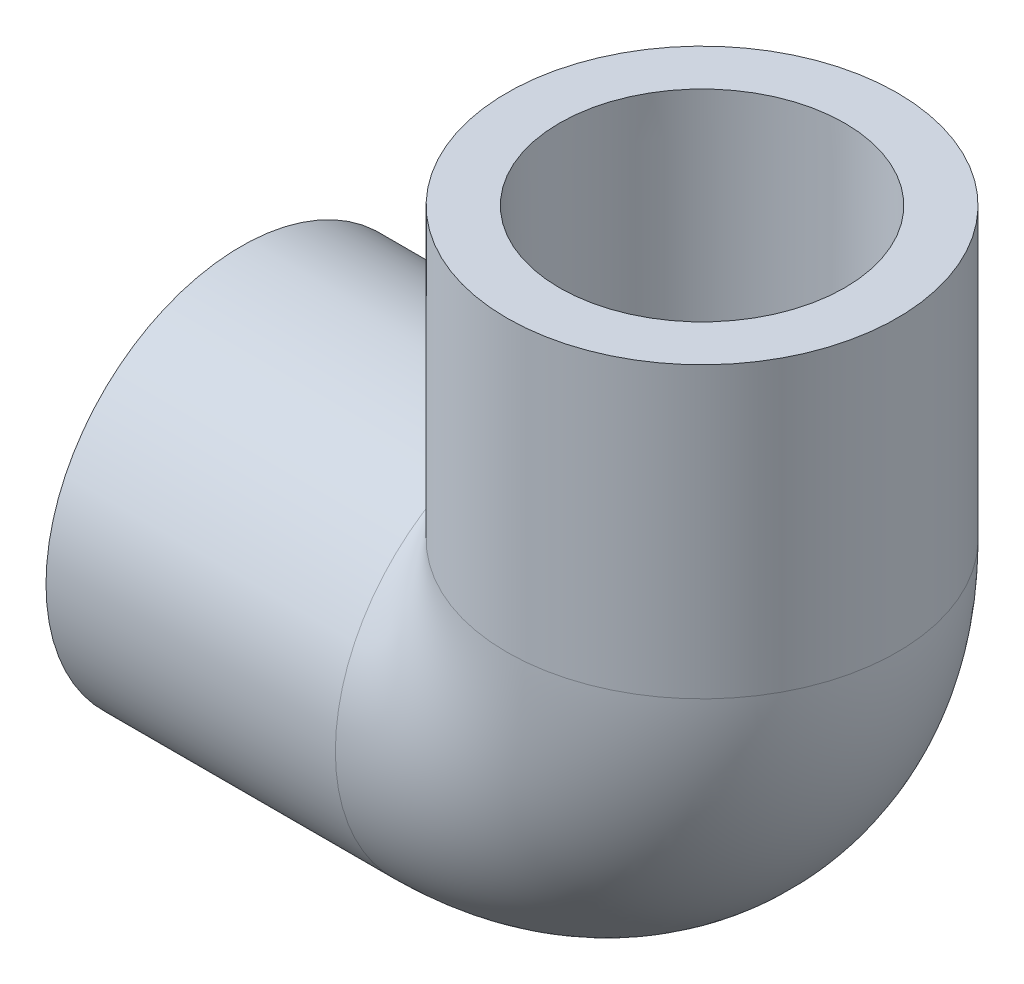
ISO-10303-21;
HEADER;
FILE_DESCRIPTION(('STEP AP214'),'2;1');
FILE_NAME('part.step','',(''),(''),'','','');
FILE_SCHEMA(('AUTOMOTIVE_DESIGN { 1 0 10303 214 1 1 1 1 }'));
ENDSEC;
DATA;
#1=APPLICATION_CONTEXT('core data for automotive mechanical design processes');
#2=APPLICATION_PROTOCOL_DEFINITION('international standard','automotive_design',2000,#1);
#3=PRODUCT_CONTEXT('',#1,'mechanical');
#4=PRODUCT('Part','Part','',(#3));
#5=PRODUCT_RELATED_PRODUCT_CATEGORY('part','',(#4));
#6=PRODUCT_DEFINITION_FORMATION('','',#4);
#7=PRODUCT_DEFINITION_CONTEXT('part definition',#1,'design');
#8=PRODUCT_DEFINITION('design','',#6,#7);
#9=PRODUCT_DEFINITION_SHAPE('','',#8);
#10=(LENGTH_UNIT() NAMED_UNIT(*) SI_UNIT(.MILLI.,.METRE.));
#11=(NAMED_UNIT(*) PLANE_ANGLE_UNIT() SI_UNIT($,.RADIAN.));
#12=(NAMED_UNIT(*) SI_UNIT($,.STERADIAN.) SOLID_ANGLE_UNIT());
#13=UNCERTAINTY_MEASURE_WITH_UNIT(LENGTH_MEASURE(1.E-05),#10,'distance_accuracy_value','');
#14=(GEOMETRIC_REPRESENTATION_CONTEXT(3) GLOBAL_UNCERTAINTY_ASSIGNED_CONTEXT((#13)) GLOBAL_UNIT_ASSIGNED_CONTEXT((#10,
#11,#12)) REPRESENTATION_CONTEXT('',''));
#15=CARTESIAN_POINT('',(0.,0.,0.));
#16=DIRECTION('',(0.,0.,1.));
#17=DIRECTION('',(1.,0.,0.));
#18=AXIS2_PLACEMENT_3D('',#15,#16,#17);
#19=CARTESIAN_POINT('',(-34.798,-14.732,0.));
#20=DIRECTION('',(-1.,0.,0.));
#21=DIRECTION('',(0.,0.,1.));
#22=AXIS2_PLACEMENT_3D('',#19,#20,#21);
#23=PLANE('',#22);
#24=CARTESIAN_POINT('',(-34.798,0.,0.));
#25=DIRECTION('',(-1.,0.,0.));
#26=DIRECTION('',(0.,0.,1.));
#27=AXIS2_PLACEMENT_3D('',#24,#25,#26);
#28=CIRCLE('',#27,14.732);
#29=CARTESIAN_POINT('',(-34.798,0.,14.732));
#30=VERTEX_POINT('',#29);
#31=EDGE_CURVE('E52',#30,#30,#28,.T.);
#32=ORIENTED_EDGE('',*,*,#31,.T.);
#33=EDGE_LOOP('',(#32));
#34=FACE_BOUND('',#33,.T.);
#35=CARTESIAN_POINT('',(-34.798,0.,0.));
#36=DIRECTION('',(-1.,0.,0.));
#37=DIRECTION('',(0.,0.,1.));
#38=AXIS2_PLACEMENT_3D('',#35,#36,#37);
#39=CIRCLE('',#38,10.7696);
#40=CARTESIAN_POINT('',(-34.798,0.,10.7696));
#41=VERTEX_POINT('',#40);
#42=EDGE_CURVE('E39',#41,#41,#39,.T.);
#43=ORIENTED_EDGE('',*,*,#42,.F.);
#44=EDGE_LOOP('',(#43));
#45=FACE_BOUND('',#44,.T.);
#46=ADVANCED_FACE('F32',(#34,#45),#23,.T.);
#47=CARTESIAN_POINT('',(-12.954,0.,0.));
#48=DIRECTION('',(-1.,0.,0.));
#49=DIRECTION('',(0.,0.,1.));
#50=AXIS2_PLACEMENT_3D('',#47,#48,#49);
#51=CONICAL_SURFACE('',#50,10.6172,0.0069766309917721);
#52=ORIENTED_EDGE('',*,*,#42,.T.);
#53=EDGE_LOOP('',(#52));
#54=FACE_BOUND('',#53,.T.);
#55=CARTESIAN_POINT('',(-12.954,0.,0.));
#56=DIRECTION('',(-1.,0.,0.));
#57=DIRECTION('',(0.,0.,1.));
#58=AXIS2_PLACEMENT_3D('',#55,#56,#57);
#59=CIRCLE('',#58,10.6172);
#60=CARTESIAN_POINT('',(-12.954,0.,10.6172));
#61=VERTEX_POINT('',#60);
#62=EDGE_CURVE('E63',#61,#61,#59,.T.);
#63=ORIENTED_EDGE('',*,*,#62,.F.);
#64=EDGE_LOOP('',(#63));
#65=FACE_BOUND('',#64,.T.);
#66=ADVANCED_FACE('F72',(#54,#65),#51,.F.);
#67=CARTESIAN_POINT('',(-34.798,0.,0.));
#68=DIRECTION('',(-1.,0.,0.));
#69=DIRECTION('',(0.,0.,1.));
#70=AXIS2_PLACEMENT_3D('',#67,#68,#69);
#71=CYLINDRICAL_SURFACE('',#70,14.732);
#72=CARTESIAN_POINT('',(0.,0.,0.));
#73=DIRECTION('',(-0.707106781186547,-0.707106781186547,0.));
#74=DIRECTION('',(-0.707106781186547,0.707106781186547,0.));
#75=AXIS2_PLACEMENT_3D('',#72,#73,#74);
#76=ELLIPSE('',#75,20.8341942008804,14.732);
#77=CARTESIAN_POINT('',(-12.954,12.954,-7.01610347700203));
#78=VERTEX_POINT('',#77);
#79=CARTESIAN_POINT('',(-12.954,12.954,7.01610347700202));
#80=VERTEX_POINT('',#79);
#81=EDGE_CURVE('E51',#78,#80,#76,.F.);
#82=ORIENTED_EDGE('',*,*,#81,.F.);
#83=CARTESIAN_POINT('',(-12.954,0.,0.));
#84=DIRECTION('',(-1.,0.,0.));
#85=DIRECTION('',(0.,0.,1.));
#86=AXIS2_PLACEMENT_3D('',#83,#84,#85);
#87=CIRCLE('',#86,14.732);
#88=EDGE_CURVE('E58',#78,#80,#87,.T.);
#89=ORIENTED_EDGE('',*,*,#88,.T.);
#90=EDGE_LOOP('',(#82,#89));
#91=FACE_BOUND('',#90,.T.);
#92=ORIENTED_EDGE('',*,*,#31,.F.);
#93=EDGE_LOOP('',(#92));
#94=FACE_BOUND('',#93,.T.);
#95=ADVANCED_FACE('F56',(#91,#94),#71,.T.);
#96=CARTESIAN_POINT('',(-12.954,12.954,0.));
#97=DIRECTION('',(0.,0.,-1.));
#98=DIRECTION('',(-1.,0.,0.));
#99=AXIS2_PLACEMENT_3D('',#96,#97,#98);
#100=TOROIDAL_SURFACE('',#99,12.954,6.9342);
#101=CARTESIAN_POINT('',(0.,12.954,0.));
#102=DIRECTION('',(0.,1.,0.));
#103=DIRECTION('',(0.,0.,-1.));
#104=AXIS2_PLACEMENT_3D('',#101,#102,#103);
#105=CIRCLE('',#104,6.9342);
#106=CARTESIAN_POINT('',(6.9342,12.954,0.));
#107=VERTEX_POINT('',#106);
#108=EDGE_CURVE('E53',#107,#107,#105,.T.);
#109=CARTESIAN_POINT('',(-12.954,0.,0.));
#110=DIRECTION('',(1.,0.,0.));
#111=DIRECTION('',(0.,0.,-1.));
#112=AXIS2_PLACEMENT_3D('',#109,#110,#111);
#113=CIRCLE('',#112,6.9342);
#114=CARTESIAN_POINT('',(-12.954,-6.9342,0.));
#115=VERTEX_POINT('',#114);
#116=EDGE_CURVE('E59',#115,#115,#113,.T.);
#117=CARTESIAN_POINT('',(-12.954,12.954,0.));
#118=DIRECTION('',(0.,0.,-1.));
#119=DIRECTION('',(-1.,0.,0.));
#120=AXIS2_PLACEMENT_3D('',#117,#118,#119);
#121=CIRCLE('',#120,19.8882);
#122=EDGE_CURVE('',#107,#115,#121,.T.);
#123=ORIENTED_EDGE('',*,*,#108,.T.);
#124=ORIENTED_EDGE('',*,*,#116,.F.);
#125=ORIENTED_EDGE('',*,*,#122,.T.);
#126=ORIENTED_EDGE('',*,*,#122,.F.);
#127=EDGE_LOOP('',(#123,#125,#124,#126));
#128=FACE_BOUND('',#127,.T.);
#129=ADVANCED_FACE('F82',(#128),#100,.F.);
#130=CARTESIAN_POINT('',(-25.908,12.954,0.));
#131=DIRECTION('',(0.,-1.,0.));
#132=DIRECTION('',(-1.,0.,0.));
#133=AXIS2_PLACEMENT_3D('',#130,#131,#132);
#134=CIRCLE('',#133,14.732);
#135=TRIMMED_CURVE('',#134,(PARAMETER_VALUE(-2.64520848846067)),
(PARAMETER_VALUE(2.64520848846067)),.T.,.PARAMETER.);
#136=CARTESIAN_POINT('',(-12.954,12.954,0.));
#137=DIRECTION('',(0.,0.,-1.));
#138=AXIS1_PLACEMENT('',#136,#137);
#139=SURFACE_OF_REVOLUTION('',#135,#138);
#140=CARTESIAN_POINT('',(0.,12.954,0.));
#141=DIRECTION('',(0.,1.,0.));
#142=DIRECTION('',(0.,0.,-1.));
#143=AXIS2_PLACEMENT_3D('',#140,#141,#142);
#144=CIRCLE('',#143,14.732);
#145=EDGE_CURVE('E45',#80,#78,#144,.T.);
#146=ORIENTED_EDGE('',*,*,#145,.F.);
#147=ORIENTED_EDGE('',*,*,#88,.F.);
#148=EDGE_LOOP('',(#146,#147));
#149=FACE_BOUND('',#148,.T.);
#150=ADVANCED_FACE('F62',(#149),#139,.T.);
#151=CARTESIAN_POINT('',(0.,12.954,0.));
#152=DIRECTION('',(0.,1.,0.));
#153=DIRECTION('',(0.,0.,-1.));
#154=AXIS2_PLACEMENT_3D('',#151,#152,#153);
#155=PLANE('',#154);
#156=CARTESIAN_POINT('',(0.,12.954,0.));
#157=DIRECTION('',(0.,1.,0.));
#158=DIRECTION('',(-1.,0.,0.));
#159=AXIS2_PLACEMENT_3D('',#156,#157,#158);
#160=CIRCLE('',#159,10.6172);
#161=CARTESIAN_POINT('',(-10.6172,12.954,0.));
#162=VERTEX_POINT('',#161);
#163=EDGE_CURVE('E11',#162,#162,#160,.F.);
#164=ORIENTED_EDGE('',*,*,#163,.F.);
#165=EDGE_LOOP('',(#164));
#166=FACE_BOUND('',#165,.T.);
#167=ORIENTED_EDGE('',*,*,#108,.F.);
#168=EDGE_LOOP('',(#167));
#169=FACE_BOUND('',#168,.T.);
#170=ADVANCED_FACE('F89',(#166,#169),#155,.T.);
#171=CARTESIAN_POINT('',(-12.954,0.,0.));
#172=DIRECTION('',(1.,0.,0.));
#173=DIRECTION('',(0.,0.,-1.));
#174=AXIS2_PLACEMENT_3D('',#171,#172,#173);
#175=PLANE('',#174);
#176=ORIENTED_EDGE('',*,*,#62,.T.);
#177=EDGE_LOOP('',(#176));
#178=FACE_BOUND('',#177,.T.);
#179=ORIENTED_EDGE('',*,*,#116,.T.);
#180=EDGE_LOOP('',(#179));
#181=FACE_BOUND('',#180,.T.);
#182=ADVANCED_FACE('F92',(#178,#181),#175,.F.);
#183=CARTESIAN_POINT('',(14.732,34.798,0.));
#184=DIRECTION('',(0.,1.,0.));
#185=DIRECTION('',(0.,0.,1.));
#186=AXIS2_PLACEMENT_3D('',#183,#184,#185);
#187=PLANE('',#186);
#188=CARTESIAN_POINT('',(0.,34.798,0.));
#189=DIRECTION('',(0.,-1.,0.));
#190=DIRECTION('',(0.,0.,-1.));
#191=AXIS2_PLACEMENT_3D('',#188,#189,#190);
#192=CIRCLE('',#191,10.7696);
#193=CARTESIAN_POINT('',(0.,34.798,-10.7696));
#194=VERTEX_POINT('',#193);
#195=EDGE_CURVE('E116',#194,#194,#192,.T.);
#196=ORIENTED_EDGE('',*,*,#195,.T.);
#197=EDGE_LOOP('',(#196));
#198=FACE_BOUND('',#197,.T.);
#199=CARTESIAN_POINT('',(0.,34.798,0.));
#200=DIRECTION('',(0.,-1.,0.));
#201=DIRECTION('',(0.,0.,-1.));
#202=AXIS2_PLACEMENT_3D('',#199,#200,#201);
#203=CIRCLE('',#202,14.732);
#204=CARTESIAN_POINT('',(0.,34.798,-14.732));
#205=VERTEX_POINT('',#204);
#206=EDGE_CURVE('E60',#205,#205,#203,.T.);
#207=ORIENTED_EDGE('',*,*,#206,.F.);
#208=EDGE_LOOP('',(#207));
#209=FACE_BOUND('',#208,.T.);
#210=ADVANCED_FACE('F99',(#198,#209),#187,.T.);
#211=CARTESIAN_POINT('',(0.,0.,0.));
#212=DIRECTION('',(0.,-1.,0.));
#213=DIRECTION('',(0.,0.,-1.));
#214=AXIS2_PLACEMENT_3D('',#211,#212,#213);
#215=CYLINDRICAL_SURFACE('',#214,14.732);
#216=ORIENTED_EDGE('',*,*,#206,.T.);
#217=EDGE_LOOP('',(#216));
#218=FACE_BOUND('',#217,.T.);
#219=ORIENTED_EDGE('',*,*,#145,.T.);
#220=ORIENTED_EDGE('',*,*,#81,.T.);
#221=EDGE_LOOP('',(#219,#220));
#222=FACE_BOUND('',#221,.T.);
#223=ADVANCED_FACE('F50',(#218,#222),#215,.T.);
#224=CARTESIAN_POINT('',(0.,34.798,0.));
#225=DIRECTION('',(0.,1.,0.));
#226=DIRECTION('',(0.,0.,1.));
#227=AXIS2_PLACEMENT_3D('',#224,#225,#226);
#228=CONICAL_SURFACE('',#227,10.7696,0.0069766309917721);
#229=ORIENTED_EDGE('',*,*,#163,.T.);
#230=EDGE_LOOP('',(#229));
#231=FACE_BOUND('',#230,.T.);
#232=ORIENTED_EDGE('',*,*,#195,.F.);
#233=EDGE_LOOP('',(#232));
#234=FACE_BOUND('',#233,.T.);
#235=ADVANCED_FACE('F106',(#231,#234),#228,.F.);
#236=CLOSED_SHELL('',(#46,#66,#95,#129,#150,#170,#182,#210,#223,#235));
#237=MANIFOLD_SOLID_BREP('B2',#236);
#238=ADVANCED_BREP_SHAPE_REPRESENTATION('',(#18,#237),#14);
#239=SHAPE_DEFINITION_REPRESENTATION(#9,#238);
ENDSEC;
END-ISO-10303-21;
